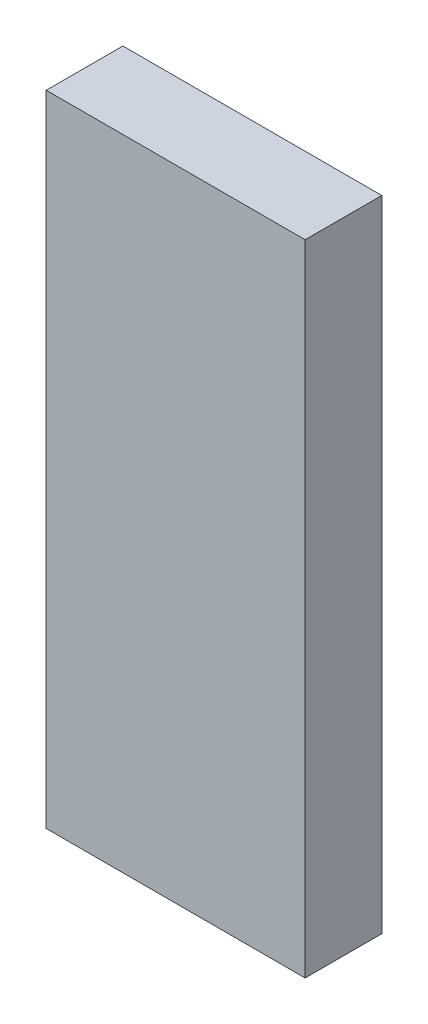
ISO-10303-21;
HEADER;
FILE_DESCRIPTION(('STEP AP214'),'2;1');
FILE_NAME('part.step','',(''),(''),'','','');
FILE_SCHEMA(('AUTOMOTIVE_DESIGN { 1 0 10303 214 1 1 1 1 }'));
ENDSEC;
DATA;
#1=APPLICATION_CONTEXT('core data for automotive mechanical design processes');
#2=APPLICATION_PROTOCOL_DEFINITION('international standard','automotive_design',2000,#1);
#3=PRODUCT_CONTEXT('',#1,'mechanical');
#4=PRODUCT('Part','Part','',(#3));
#5=PRODUCT_RELATED_PRODUCT_CATEGORY('part','',(#4));
#6=PRODUCT_DEFINITION_FORMATION('','',#4);
#7=PRODUCT_DEFINITION_CONTEXT('part definition',#1,'design');
#8=PRODUCT_DEFINITION('design','',#6,#7);
#9=PRODUCT_DEFINITION_SHAPE('','',#8);
#10=(LENGTH_UNIT() NAMED_UNIT(*) SI_UNIT(.MILLI.,.METRE.));
#11=(NAMED_UNIT(*) PLANE_ANGLE_UNIT() SI_UNIT($,.RADIAN.));
#12=(NAMED_UNIT(*) SI_UNIT($,.STERADIAN.) SOLID_ANGLE_UNIT());
#13=UNCERTAINTY_MEASURE_WITH_UNIT(LENGTH_MEASURE(1.E-05),#10,'distance_accuracy_value','');
#14=(GEOMETRIC_REPRESENTATION_CONTEXT(3) GLOBAL_UNCERTAINTY_ASSIGNED_CONTEXT((#13)) GLOBAL_UNIT_ASSIGNED_CONTEXT((#10,
#11,#12)) REPRESENTATION_CONTEXT('',''));
#15=CARTESIAN_POINT('',(0.,0.,0.));
#16=DIRECTION('',(0.,0.,1.));
#17=DIRECTION('',(1.,0.,0.));
#18=AXIS2_PLACEMENT_3D('',#15,#16,#17);
#19=CARTESIAN_POINT('',(0.62500002,1.5434945,0.36999926));
#20=DIRECTION('',(0.,0.,1.));
#21=DIRECTION('',(1.,0.,0.));
#22=AXIS2_PLACEMENT_3D('',#19,#20,#21);
#23=PLANE('',#22);
#24=DIRECTION('',(1.,0.,0.));
#25=VECTOR('',#24,1.);
#26=CARTESIAN_POINT('',(-0.62500002,1.5434945,0.36999926));
#27=LINE('',#26,#25);
#28=CARTESIAN_POINT('',(-0.62500002,1.5434945,0.36999926));
#29=VERTEX_POINT('',#28);
#30=CARTESIAN_POINT('',(0.62500002,1.5434945,0.36999926));
#31=VERTEX_POINT('',#30);
#32=EDGE_CURVE('E26',#29,#31,#27,.T.);
#33=ORIENTED_EDGE('',*,*,#32,.F.);
#34=DIRECTION('',(0.,1.,0.));
#35=VECTOR('',#34,1.);
#36=CARTESIAN_POINT('',(-0.62500002,-1.54349196,0.36999926));
#37=LINE('',#36,#35);
#38=CARTESIAN_POINT('',(-0.62500002,-1.54349196,0.36999926));
#39=VERTEX_POINT('',#38);
#40=EDGE_CURVE('E20',#39,#29,#37,.T.);
#41=ORIENTED_EDGE('',*,*,#40,.F.);
#42=DIRECTION('',(-1.,0.,0.));
#43=VECTOR('',#42,1.);
#44=CARTESIAN_POINT('',(0.62500002,-1.54349196,0.36999926));
#45=LINE('',#44,#43);
#46=CARTESIAN_POINT('',(0.62500002,-1.54349196,0.36999926));
#47=VERTEX_POINT('',#46);
#48=EDGE_CURVE('E82',#47,#39,#45,.T.);
#49=ORIENTED_EDGE('',*,*,#48,.F.);
#50=DIRECTION('',(0.,-1.,0.));
#51=VECTOR('',#50,1.);
#52=CARTESIAN_POINT('',(0.62500002,1.5434945,0.36999926));
#53=LINE('',#52,#51);
#54=EDGE_CURVE('E80',#31,#47,#53,.T.);
#55=ORIENTED_EDGE('',*,*,#54,.F.);
#56=EDGE_LOOP('',(#33,#41,#49,#55));
#57=FACE_BOUND('',#56,.T.);
#58=ADVANCED_FACE('F16',(#57),#23,.T.);
#59=CARTESIAN_POINT('',(0.62500002,1.5434945,0.));
#60=DIRECTION('',(0.,0.,1.));
#61=DIRECTION('',(1.,0.,0.));
#62=AXIS2_PLACEMENT_3D('',#59,#60,#61);
#63=PLANE('',#62);
#64=DIRECTION('',(0.,-1.,0.));
#65=VECTOR('',#64,1.);
#66=CARTESIAN_POINT('',(0.62500002,1.5434945,0.));
#67=LINE('',#66,#65);
#68=CARTESIAN_POINT('',(0.62500002,1.5434945,0.));
#69=VERTEX_POINT('',#68);
#70=CARTESIAN_POINT('',(0.62500002,-1.54349196,0.));
#71=VERTEX_POINT('',#70);
#72=EDGE_CURVE('E90',#69,#71,#67,.T.);
#73=ORIENTED_EDGE('',*,*,#72,.T.);
#74=DIRECTION('',(-1.,0.,0.));
#75=VECTOR('',#74,1.);
#76=CARTESIAN_POINT('',(0.62500002,-1.54349196,0.));
#77=LINE('',#76,#75);
#78=CARTESIAN_POINT('',(-0.62500002,-1.54349196,0.));
#79=VERTEX_POINT('',#78);
#80=EDGE_CURVE('E101',#71,#79,#77,.T.);
#81=ORIENTED_EDGE('',*,*,#80,.T.);
#82=DIRECTION('',(0.,1.,0.));
#83=VECTOR('',#82,1.);
#84=CARTESIAN_POINT('',(-0.62500002,-1.54349196,0.));
#85=LINE('',#84,#83);
#86=CARTESIAN_POINT('',(-0.62500002,1.5434945,0.));
#87=VERTEX_POINT('',#86);
#88=EDGE_CURVE('E77',#79,#87,#85,.T.);
#89=ORIENTED_EDGE('',*,*,#88,.T.);
#90=DIRECTION('',(1.,0.,0.));
#91=VECTOR('',#90,1.);
#92=CARTESIAN_POINT('',(-0.62500002,1.5434945,0.));
#93=LINE('',#92,#91);
#94=EDGE_CURVE('E10',#87,#69,#93,.T.);
#95=ORIENTED_EDGE('',*,*,#94,.T.);
#96=EDGE_LOOP('',(#73,#81,#89,#95));
#97=FACE_BOUND('',#96,.T.);
#98=ADVANCED_FACE('F121',(#97),#63,.F.);
#99=CARTESIAN_POINT('',(-0.62500002,1.5434945,0.));
#100=DIRECTION('',(0.,1.,0.));
#101=DIRECTION('',(1.,0.,0.));
#102=AXIS2_PLACEMENT_3D('',#99,#100,#101);
#103=PLANE('',#102);
#104=DIRECTION('',(0.,0.,1.));
#105=VECTOR('',#104,1.);
#106=CARTESIAN_POINT('',(-0.62500002,1.5434945,0.));
#107=LINE('',#106,#105);
#108=EDGE_CURVE('E74',#87,#29,#107,.T.);
#109=ORIENTED_EDGE('',*,*,#108,.T.);
#110=ORIENTED_EDGE('',*,*,#32,.T.);
#111=DIRECTION('',(0.,0.,1.));
#112=VECTOR('',#111,1.);
#113=CARTESIAN_POINT('',(0.62500002,1.5434945,0.));
#114=LINE('',#113,#112);
#115=EDGE_CURVE('E72',#69,#31,#114,.T.);
#116=ORIENTED_EDGE('',*,*,#115,.F.);
#117=ORIENTED_EDGE('',*,*,#94,.F.);
#118=EDGE_LOOP('',(#109,#110,#116,#117));
#119=FACE_BOUND('',#118,.T.);
#120=ADVANCED_FACE('F70',(#119),#103,.T.);
#121=CARTESIAN_POINT('',(-0.62500002,-1.54349196,0.));
#122=DIRECTION('',(-1.,0.,0.));
#123=DIRECTION('',(0.,0.,1.));
#124=AXIS2_PLACEMENT_3D('',#121,#122,#123);
#125=PLANE('',#124);
#126=DIRECTION('',(0.,0.,1.));
#127=VECTOR('',#126,1.);
#128=CARTESIAN_POINT('',(-0.62500002,-1.54349196,0.));
#129=LINE('',#128,#127);
#130=EDGE_CURVE('E97',#79,#39,#129,.T.);
#131=ORIENTED_EDGE('',*,*,#130,.T.);
#132=ORIENTED_EDGE('',*,*,#40,.T.);
#133=ORIENTED_EDGE('',*,*,#108,.F.);
#134=ORIENTED_EDGE('',*,*,#88,.F.);
#135=EDGE_LOOP('',(#131,#132,#133,#134));
#136=FACE_BOUND('',#135,.T.);
#137=ADVANCED_FACE('F129',(#136),#125,.T.);
#138=CARTESIAN_POINT('',(0.62500002,-1.54349196,0.));
#139=DIRECTION('',(0.,-1.,0.));
#140=DIRECTION('',(0.,0.,-1.));
#141=AXIS2_PLACEMENT_3D('',#138,#139,#140);
#142=PLANE('',#141);
#143=DIRECTION('',(0.,0.,1.));
#144=VECTOR('',#143,1.);
#145=CARTESIAN_POINT('',(0.62500002,-1.54349196,0.));
#146=LINE('',#145,#144);
#147=EDGE_CURVE('E87',#71,#47,#146,.T.);
#148=ORIENTED_EDGE('',*,*,#147,.T.);
#149=ORIENTED_EDGE('',*,*,#48,.T.);
#150=ORIENTED_EDGE('',*,*,#130,.F.);
#151=ORIENTED_EDGE('',*,*,#80,.F.);
#152=EDGE_LOOP('',(#148,#149,#150,#151));
#153=FACE_BOUND('',#152,.T.);
#154=ADVANCED_FACE('F18',(#153),#142,.T.);
#155=CARTESIAN_POINT('',(0.62500002,1.5434945,0.));
#156=DIRECTION('',(1.,0.,0.));
#157=DIRECTION('',(0.,1.,0.));
#158=AXIS2_PLACEMENT_3D('',#155,#156,#157);
#159=PLANE('',#158);
#160=ORIENTED_EDGE('',*,*,#115,.T.);
#161=ORIENTED_EDGE('',*,*,#54,.T.);
#162=ORIENTED_EDGE('',*,*,#147,.F.);
#163=ORIENTED_EDGE('',*,*,#72,.F.);
#164=EDGE_LOOP('',(#160,#161,#162,#163));
#165=FACE_BOUND('',#164,.T.);
#166=ADVANCED_FACE('F89',(#165),#159,.T.);
#167=CLOSED_SHELL('',(#58,#98,#120,#137,#154,#166));
#168=MANIFOLD_SOLID_BREP('B1',#167);
#169=ADVANCED_BREP_SHAPE_REPRESENTATION('',(#18,#168),#14);
#170=SHAPE_DEFINITION_REPRESENTATION(#9,#169);
ENDSEC;
END-ISO-10303-21;
